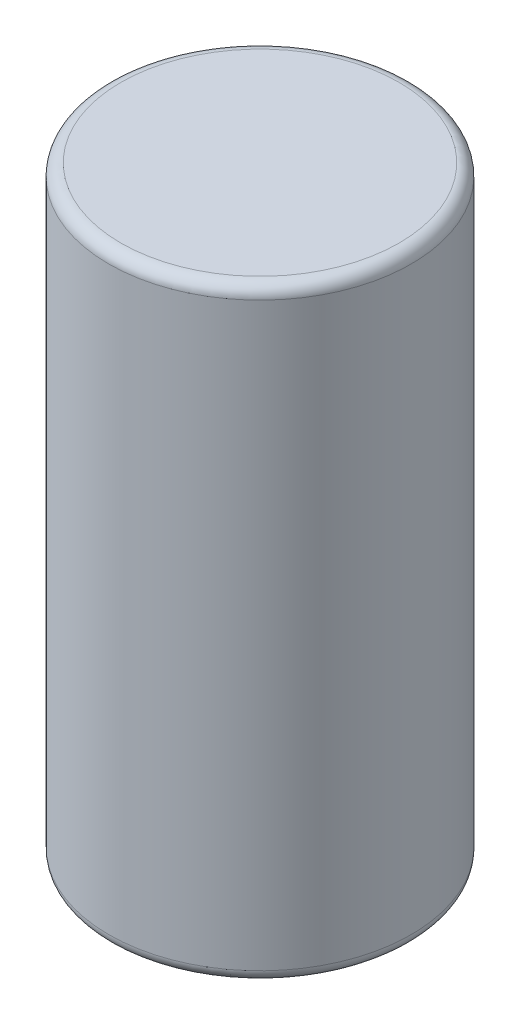
ISO-10303-21;
HEADER;
FILE_DESCRIPTION(('STEP AP214'),'2;1');
FILE_NAME('part.step','',(''),(''),'','','');
FILE_SCHEMA(('AUTOMOTIVE_DESIGN { 1 0 10303 214 1 1 1 1 }'));
ENDSEC;
DATA;
#1=APPLICATION_CONTEXT('core data for automotive mechanical design processes');
#2=APPLICATION_PROTOCOL_DEFINITION('international standard','automotive_design',2000,#1);
#3=PRODUCT_CONTEXT('',#1,'mechanical');
#4=PRODUCT('Part','Part','',(#3));
#5=PRODUCT_RELATED_PRODUCT_CATEGORY('part','',(#4));
#6=PRODUCT_DEFINITION_FORMATION('','',#4);
#7=PRODUCT_DEFINITION_CONTEXT('part definition',#1,'design');
#8=PRODUCT_DEFINITION('design','',#6,#7);
#9=PRODUCT_DEFINITION_SHAPE('','',#8);
#10=(LENGTH_UNIT() NAMED_UNIT(*) SI_UNIT(.MILLI.,.METRE.));
#11=(NAMED_UNIT(*) PLANE_ANGLE_UNIT() SI_UNIT($,.RADIAN.));
#12=(NAMED_UNIT(*) SI_UNIT($,.STERADIAN.) SOLID_ANGLE_UNIT());
#13=UNCERTAINTY_MEASURE_WITH_UNIT(LENGTH_MEASURE(1.E-05),#10,'distance_accuracy_value','');
#14=(GEOMETRIC_REPRESENTATION_CONTEXT(3) GLOBAL_UNCERTAINTY_ASSIGNED_CONTEXT((#13)) GLOBAL_UNIT_ASSIGNED_CONTEXT((#10,
#11,#12)) REPRESENTATION_CONTEXT('',''));
#15=CARTESIAN_POINT('',(0.,0.,0.));
#16=DIRECTION('',(0.,0.,1.));
#17=DIRECTION('',(1.,0.,0.));
#18=AXIS2_PLACEMENT_3D('',#15,#16,#17);
#19=CARTESIAN_POINT('',(0.,6.096,0.));
#20=DIRECTION('',(0.,-1.,0.));
#21=DIRECTION('',(0.,0.,-1.));
#22=AXIS2_PLACEMENT_3D('',#19,#20,#21);
#23=TOROIDAL_SURFACE('',#22,2.921,0.254);
#24=CARTESIAN_POINT('',(0.,6.35,0.));
#25=DIRECTION('',(0.,-1.,0.));
#26=DIRECTION('',(0.,0.,-1.));
#27=AXIS2_PLACEMENT_3D('',#24,#25,#26);
#28=CIRCLE('',#27,2.921);
#29=CARTESIAN_POINT('',(0.,6.35,-2.921));
#30=VERTEX_POINT('',#29);
#31=EDGE_CURVE('E10',#30,#30,#28,.T.);
#32=ORIENTED_EDGE('',*,*,#31,.T.);
#33=EDGE_LOOP('',(#32));
#34=FACE_BOUND('',#33,.T.);
#35=CARTESIAN_POINT('',(0.,6.096,0.));
#36=DIRECTION('',(0.,-1.,0.));
#37=DIRECTION('',(0.,0.,-1.));
#38=AXIS2_PLACEMENT_3D('',#35,#36,#37);
#39=CIRCLE('',#38,3.175);
#40=CARTESIAN_POINT('',(0.,6.096,-3.175));
#41=VERTEX_POINT('',#40);
#42=EDGE_CURVE('E49',#41,#41,#39,.T.);
#43=ORIENTED_EDGE('',*,*,#42,.F.);
#44=EDGE_LOOP('',(#43));
#45=FACE_BOUND('',#44,.T.);
#46=ADVANCED_FACE('F35',(#34,#45),#23,.T.);
#47=CARTESIAN_POINT('',(2.921,6.35,0.));
#48=DIRECTION('',(0.,1.,0.));
#49=DIRECTION('',(0.,0.,1.));
#50=AXIS2_PLACEMENT_3D('',#47,#48,#49);
#51=PLANE('',#50);
#52=ORIENTED_EDGE('',*,*,#31,.F.);
#53=EDGE_LOOP('',(#52));
#54=FACE_BOUND('',#53,.T.);
#55=ADVANCED_FACE('F59',(#54),#51,.T.);
#56=CARTESIAN_POINT('',(0.,-6.35,0.));
#57=DIRECTION('',(0.,-1.,0.));
#58=DIRECTION('',(0.,0.,-1.));
#59=AXIS2_PLACEMENT_3D('',#56,#57,#58);
#60=PLANE('',#59);
#61=CARTESIAN_POINT('',(0.,-6.35,0.));
#62=DIRECTION('',(0.,-1.,0.));
#63=DIRECTION('',(0.,0.,-1.));
#64=AXIS2_PLACEMENT_3D('',#61,#62,#63);
#65=CIRCLE('',#64,2.921);
#66=CARTESIAN_POINT('',(0.,-6.35,-2.921));
#67=VERTEX_POINT('',#66);
#68=EDGE_CURVE('E41',#67,#67,#65,.T.);
#69=ORIENTED_EDGE('',*,*,#68,.T.);
#70=EDGE_LOOP('',(#69));
#71=FACE_BOUND('',#70,.T.);
#72=ADVANCED_FACE('F63',(#71),#60,.T.);
#73=CARTESIAN_POINT('',(0.,-6.096,0.));
#74=DIRECTION('',(0.,-1.,0.));
#75=DIRECTION('',(0.,0.,-1.));
#76=AXIS2_PLACEMENT_3D('',#73,#74,#75);
#77=TOROIDAL_SURFACE('',#76,2.921,0.254);
#78=CARTESIAN_POINT('',(0.,-6.096,0.));
#79=DIRECTION('',(0.,-1.,0.));
#80=DIRECTION('',(0.,0.,-1.));
#81=AXIS2_PLACEMENT_3D('',#78,#79,#80);
#82=CIRCLE('',#81,3.175);
#83=CARTESIAN_POINT('',(0.,-6.096,-3.175));
#84=VERTEX_POINT('',#83);
#85=EDGE_CURVE('E45',#84,#84,#82,.T.);
#86=ORIENTED_EDGE('',*,*,#85,.T.);
#87=EDGE_LOOP('',(#86));
#88=FACE_BOUND('',#87,.T.);
#89=ORIENTED_EDGE('',*,*,#68,.F.);
#90=EDGE_LOOP('',(#89));
#91=FACE_BOUND('',#90,.T.);
#92=ADVANCED_FACE('F68',(#88,#91),#77,.T.);
#93=CARTESIAN_POINT('',(0.,6.35,0.));
#94=DIRECTION('',(0.,-1.,0.));
#95=DIRECTION('',(0.,0.,-1.));
#96=AXIS2_PLACEMENT_3D('',#93,#94,#95);
#97=CYLINDRICAL_SURFACE('',#96,3.175);
#98=ORIENTED_EDGE('',*,*,#42,.T.);
#99=EDGE_LOOP('',(#98));
#100=FACE_BOUND('',#99,.T.);
#101=ORIENTED_EDGE('',*,*,#85,.F.);
#102=EDGE_LOOP('',(#101));
#103=FACE_BOUND('',#102,.T.);
#104=ADVANCED_FACE('F55',(#100,#103),#97,.T.);
#105=CLOSED_SHELL('',(#46,#55,#72,#92,#104));
#106=MANIFOLD_SOLID_BREP('B2',#105);
#107=ADVANCED_BREP_SHAPE_REPRESENTATION('',(#18,#106),#14);
#108=SHAPE_DEFINITION_REPRESENTATION(#9,#107);
ENDSEC;
END-ISO-10303-21;
